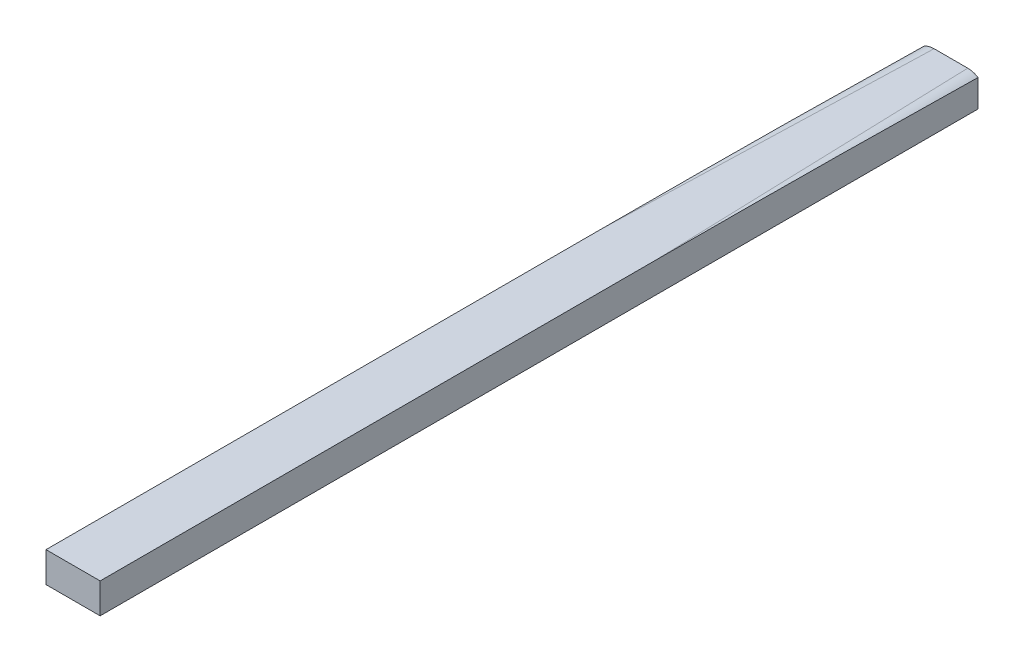
ISO-10303-21;
HEADER;
FILE_DESCRIPTION(('STEP AP214'),'2;1');
FILE_NAME('part.step','',(''),(''),'','','');
FILE_SCHEMA(('AUTOMOTIVE_DESIGN { 1 0 10303 214 1 1 1 1 }'));
ENDSEC;
DATA;
#1=APPLICATION_CONTEXT('core data for automotive mechanical design processes');
#2=APPLICATION_PROTOCOL_DEFINITION('international standard','automotive_design',2000,#1);
#3=PRODUCT_CONTEXT('',#1,'mechanical');
#4=PRODUCT('Part','Part','',(#3));
#5=PRODUCT_RELATED_PRODUCT_CATEGORY('part','',(#4));
#6=PRODUCT_DEFINITION_FORMATION('','',#4);
#7=PRODUCT_DEFINITION_CONTEXT('part definition',#1,'design');
#8=PRODUCT_DEFINITION('design','',#6,#7);
#9=PRODUCT_DEFINITION_SHAPE('','',#8);
#10=(LENGTH_UNIT() NAMED_UNIT(*) SI_UNIT(.MILLI.,.METRE.));
#11=(NAMED_UNIT(*) PLANE_ANGLE_UNIT() SI_UNIT($,.RADIAN.));
#12=(NAMED_UNIT(*) SI_UNIT($,.STERADIAN.) SOLID_ANGLE_UNIT());
#13=UNCERTAINTY_MEASURE_WITH_UNIT(LENGTH_MEASURE(1.E-05),#10,'distance_accuracy_value','');
#14=(GEOMETRIC_REPRESENTATION_CONTEXT(3) GLOBAL_UNCERTAINTY_ASSIGNED_CONTEXT((#13)) GLOBAL_UNIT_ASSIGNED_CONTEXT((#10,
#11,#12)) REPRESENTATION_CONTEXT('',''));
#15=CARTESIAN_POINT('',(0.,0.,0.));
#16=DIRECTION('',(0.,0.,1.));
#17=DIRECTION('',(1.,0.,0.));
#18=AXIS2_PLACEMENT_3D('',#15,#16,#17);
#19=CARTESIAN_POINT('',(0.,0.,-584.2));
#20=DIRECTION('',(0.,0.,1.));
#21=DIRECTION('',(1.,0.,0.));
#22=AXIS2_PLACEMENT_3D('',#19,#20,#21);
#23=PLANE('',#22);
#24=DIRECTION('',(0.,-1.,0.));
#25=VECTOR('',#24,1.);
#26=CARTESIAN_POINT('',(-18.161,0.,-584.2));
#27=LINE('',#26,#25);
#28=CARTESIAN_POINT('',(-18.161,49.911,-584.2));
#29=VERTEX_POINT('',#28);
#30=CARTESIAN_POINT('',(-18.161,29.591,-584.2));
#31=VERTEX_POINT('',#30);
#32=EDGE_CURVE('E118',#29,#31,#27,.T.);
#33=ORIENTED_EDGE('',*,*,#32,.T.);
#34=DIRECTION('',(1.,0.,0.));
#35=VECTOR('',#34,1.);
#36=CARTESIAN_POINT('',(0.,29.591,-584.2));
#37=LINE('',#36,#35);
#38=CARTESIAN_POINT('',(18.161,29.591,-584.2));
#39=VERTEX_POINT('',#38);
#40=EDGE_CURVE('E111',#31,#39,#37,.T.);
#41=ORIENTED_EDGE('',*,*,#40,.T.);
#42=DIRECTION('',(0.,-1.,0.));
#43=VECTOR('',#42,1.);
#44=CARTESIAN_POINT('',(18.161,0.,-584.2));
#45=LINE('',#44,#43);
#46=CARTESIAN_POINT('',(18.161,49.911,-584.2));
#47=VERTEX_POINT('',#46);
#48=EDGE_CURVE('E96',#47,#39,#45,.T.);
#49=ORIENTED_EDGE('',*,*,#48,.F.);
#50=DIRECTION('',(-1.,0.,0.));
#51=VECTOR('',#50,1.);
#52=CARTESIAN_POINT('',(-49.911,49.911,-584.2));
#53=LINE('',#52,#51);
#54=EDGE_CURVE('E109',#47,#29,#53,.T.);
#55=ORIENTED_EDGE('',*,*,#54,.T.);
#56=EDGE_LOOP('',(#33,#41,#49,#55));
#57=FACE_BOUND('',#56,.T.);
#58=ADVANCED_FACE('F43',(#57),#23,.T.);
#59=CARTESIAN_POINT('',(0.,29.591,0.));
#60=DIRECTION('',(0.,1.,0.));
#61=DIRECTION('',(0.,0.,1.));
#62=AXIS2_PLACEMENT_3D('',#59,#60,#61);
#63=PLANE('',#62);
#64=ORIENTED_EDGE('',*,*,#40,.F.);
#65=DIRECTION('',(0.,0.,1.));
#66=VECTOR('',#65,1.);
#67=CARTESIAN_POINT('',(-18.161,29.591,0.));
#68=LINE('',#67,#66);
#69=CARTESIAN_POINT('',(-18.161,29.591,-1173.17130026192));
#70=VERTEX_POINT('',#69);
#71=EDGE_CURVE('E51',#70,#31,#68,.T.);
#72=ORIENTED_EDGE('',*,*,#71,.F.);
#73=DIRECTION('',(-1.,0.,0.));
#74=VECTOR('',#73,1.);
#75=CARTESIAN_POINT('',(0.,29.591,-1173.17130026192));
#76=LINE('',#75,#74);
#77=CARTESIAN_POINT('',(18.161,29.591,-1173.17130026192));
#78=VERTEX_POINT('',#77);
#79=EDGE_CURVE('E58',#78,#70,#76,.T.);
#80=ORIENTED_EDGE('',*,*,#79,.F.);
#81=DIRECTION('',(0.,0.,1.));
#82=VECTOR('',#81,1.);
#83=CARTESIAN_POINT('',(18.161,29.591,0.));
#84=LINE('',#83,#82);
#85=EDGE_CURVE('E11',#78,#39,#84,.T.);
#86=ORIENTED_EDGE('',*,*,#85,.T.);
#87=EDGE_LOOP('',(#64,#72,#80,#86));
#88=FACE_BOUND('',#87,.T.);
#89=ADVANCED_FACE('F156',(#88),#63,.F.);
#90=CARTESIAN_POINT('',(-18.161,0.,0.));
#91=DIRECTION('',(1.,0.,0.));
#92=DIRECTION('',(0.,0.,-1.));
#93=AXIS2_PLACEMENT_3D('',#90,#91,#92);
#94=PLANE('',#93);
#95=ORIENTED_EDGE('',*,*,#32,.F.);
#96=DIRECTION('',(0.,0.,1.));
#97=VECTOR('',#96,1.);
#98=CARTESIAN_POINT('',(-18.161,49.911,25.4));
#99=LINE('',#98,#97);
#100=CARTESIAN_POINT('',(-18.161,49.911,-956.672711129882));
#101=VERTEX_POINT('',#100);
#102=EDGE_CURVE('E116',#101,#29,#99,.T.);
#103=ORIENTED_EDGE('',*,*,#102,.F.);
#104=CARTESIAN_POINT('',(-18.161,37.211,-956.672711129882));
#105=DIRECTION('',(1.,0.,0.));
#106=DIRECTION('',(0.,0.,1.));
#107=AXIS2_PLACEMENT_3D('',#104,#105,#106);
#108=ELLIPSE('',#107,400.982688870119,12.7);
#109=CARTESIAN_POINT('',(-18.161,47.9007971720491,-1173.17130026192));
#110=VERTEX_POINT('',#109);
#111=EDGE_CURVE('E103',#101,#110,#108,.F.);
#112=ORIENTED_EDGE('',*,*,#111,.T.);
#113=DIRECTION('',(0.,1.,0.));
#114=VECTOR('',#113,1.);
#115=CARTESIAN_POINT('',(-18.161,0.,-1173.17130026192));
#116=LINE('',#115,#114);
#117=EDGE_CURVE('E123',#70,#110,#116,.T.);
#118=ORIENTED_EDGE('',*,*,#117,.F.);
#119=ORIENTED_EDGE('',*,*,#71,.T.);
#120=EDGE_LOOP('',(#95,#103,#112,#118,#119));
#121=FACE_BOUND('',#120,.T.);
#122=ADVANCED_FACE('F154',(#121),#94,.F.);
#123=CARTESIAN_POINT('',(18.161,0.,0.));
#124=DIRECTION('',(1.,0.,0.));
#125=DIRECTION('',(0.,0.,-1.));
#126=AXIS2_PLACEMENT_3D('',#123,#124,#125);
#127=PLANE('',#126);
#128=DIRECTION('',(0.,0.,1.));
#129=VECTOR('',#128,1.);
#130=CARTESIAN_POINT('',(18.161,49.911,25.4));
#131=LINE('',#130,#129);
#132=CARTESIAN_POINT('',(18.161,49.911,-956.672711129881));
#133=VERTEX_POINT('',#132);
#134=EDGE_CURVE('E93',#133,#47,#131,.T.);
#135=ORIENTED_EDGE('',*,*,#134,.T.);
#136=ORIENTED_EDGE('',*,*,#48,.T.);
#137=ORIENTED_EDGE('',*,*,#85,.F.);
#138=DIRECTION('',(0.,1.,0.));
#139=VECTOR('',#138,1.);
#140=CARTESIAN_POINT('',(18.161,0.,-1173.17130026192));
#141=LINE('',#140,#139);
#142=CARTESIAN_POINT('',(18.161,47.900797172049,-1173.17130026192));
#143=VERTEX_POINT('',#142);
#144=EDGE_CURVE('E104',#78,#143,#141,.T.);
#145=ORIENTED_EDGE('',*,*,#144,.T.);
#146=CARTESIAN_POINT('',(18.161,37.211,-956.672711129881));
#147=DIRECTION('',(1.,0.,0.));
#148=DIRECTION('',(0.,0.,1.));
#149=AXIS2_PLACEMENT_3D('',#146,#147,#148);
#150=ELLIPSE('',#149,400.982688870118,12.7);
#151=EDGE_CURVE('E99',#133,#143,#150,.F.);
#152=ORIENTED_EDGE('',*,*,#151,.F.);
#153=EDGE_LOOP('',(#135,#136,#137,#145,#152));
#154=FACE_BOUND('',#153,.T.);
#155=ADVANCED_FACE('F95',(#154),#127,.T.);
#156=CARTESIAN_POINT('',(-49.911,49.911,25.4));
#157=DIRECTION('',(0.,-1.,0.));
#158=DIRECTION('',(0.,0.,-1.));
#159=AXIS2_PLACEMENT_3D('',#156,#157,#158);
#160=PLANE('',#159);
#161=ORIENTED_EDGE('',*,*,#54,.F.);
#162=ORIENTED_EDGE('',*,*,#134,.F.);
#163=DIRECTION('',(0.0316721902279269,0.,0.999498310336824));
#164=VECTOR('',#163,1.);
#165=CARTESIAN_POINT('',(49.1815040674601,49.911,22.2599480293983));
#166=LINE('',#165,#164);
#167=CARTESIAN_POINT('',(11.3005736959707,49.911,-1173.17130026192));
#168=VERTEX_POINT('',#167);
#169=EDGE_CURVE('E112',#133,#168,#166,.F.);
#170=ORIENTED_EDGE('',*,*,#169,.T.);
#171=DIRECTION('',(-1.,0.,0.));
#172=VECTOR('',#171,1.);
#173=CARTESIAN_POINT('',(-49.911,49.911,-1173.17130026192));
#174=LINE('',#173,#172);
#175=CARTESIAN_POINT('',(-11.3005736959707,49.911,-1173.17130026192));
#176=VERTEX_POINT('',#175);
#177=EDGE_CURVE('E147',#168,#176,#174,.T.);
#178=ORIENTED_EDGE('',*,*,#177,.T.);
#179=DIRECTION('',(-0.0316721902279268,0.,0.999498310336824));
#180=VECTOR('',#179,1.);
#181=CARTESIAN_POINT('',(-49.2816382741247,49.911,25.4199432696363));
#182=LINE('',#181,#180);
#183=EDGE_CURVE('E139',#176,#101,#182,.T.);
#184=ORIENTED_EDGE('',*,*,#183,.T.);
#185=ORIENTED_EDGE('',*,*,#102,.T.);
#186=EDGE_LOOP('',(#161,#162,#170,#178,#184,#185));
#187=FACE_BOUND('',#186,.T.);
#188=ADVANCED_FACE('F45',(#187),#160,.F.);
#189=CARTESIAN_POINT('',(0.,0.,-1173.17130026192));
#190=DIRECTION('',(0.,0.,1.));
#191=DIRECTION('',(1.,0.,0.));
#192=AXIS2_PLACEMENT_3D('',#189,#190,#191);
#193=PLANE('',#192);
#194=ORIENTED_EDGE('',*,*,#144,.F.);
#195=ORIENTED_EDGE('',*,*,#79,.T.);
#196=ORIENTED_EDGE('',*,*,#117,.T.);
#197=CARTESIAN_POINT('',(-11.3005736959707,37.211,-1173.17130026192));
#198=DIRECTION('',(0.,0.,1.));
#199=DIRECTION('',(-1.,0.,0.));
#200=AXIS2_PLACEMENT_3D('',#197,#198,#199);
#201=ELLIPSE('',#200,12.7063746568218,12.7);
#202=EDGE_CURVE('E140',#110,#176,#201,.F.);
#203=ORIENTED_EDGE('',*,*,#202,.T.);
#204=ORIENTED_EDGE('',*,*,#177,.F.);
#205=CARTESIAN_POINT('',(11.3005736959708,37.211,-1173.17130026192));
#206=DIRECTION('',(0.,0.,1.));
#207=DIRECTION('',(1.,0.,0.));
#208=AXIS2_PLACEMENT_3D('',#205,#206,#207);
#209=ELLIPSE('',#208,12.7063746568218,12.7);
#210=EDGE_CURVE('E142',#168,#143,#209,.F.);
#211=ORIENTED_EDGE('',*,*,#210,.T.);
#212=EDGE_LOOP('',(#194,#195,#196,#203,#204,#211));
#213=FACE_BOUND('',#212,.T.);
#214=ADVANCED_FACE('F170',(#213),#193,.F.);
#215=CARTESIAN_POINT('',(48.4275011351085,37.211,-1.5345749085833));
#216=DIRECTION('',(0.0316721902279269,0.,0.999498310336824));
#217=DIRECTION('',(0.999498310336824,0.,-0.0316721902279269));
#218=AXIS2_PLACEMENT_3D('',#215,#216,#217);
#219=CYLINDRICAL_SURFACE('',#218,12.7);
#220=ORIENTED_EDGE('',*,*,#169,.F.);
#221=ORIENTED_EDGE('',*,*,#151,.T.);
#222=ORIENTED_EDGE('',*,*,#210,.F.);
#223=EDGE_LOOP('',(#220,#221,#222));
#224=FACE_BOUND('',#223,.T.);
#225=ADVANCED_FACE('F167',(#224),#219,.T.);
#226=CARTESIAN_POINT('',(-49.2816382741247,37.211,25.4199432696363));
#227=DIRECTION('',(-0.0316721902279268,0.,0.999498310336824));
#228=DIRECTION('',(0.999498310336824,0.,0.0316721902279268));
#229=AXIS2_PLACEMENT_3D('',#226,#227,#228);
#230=CYLINDRICAL_SURFACE('',#229,12.7);
#231=ORIENTED_EDGE('',*,*,#111,.F.);
#232=ORIENTED_EDGE('',*,*,#183,.F.);
#233=ORIENTED_EDGE('',*,*,#202,.F.);
#234=EDGE_LOOP('',(#231,#232,#233));
#235=FACE_BOUND('',#234,.T.);
#236=ADVANCED_FACE('F153',(#235),#230,.T.);
#237=CLOSED_SHELL('',(#58,#89,#122,#155,#188,#214,#225,#236));
#238=MANIFOLD_SOLID_BREP('B2',#237);
#239=ADVANCED_BREP_SHAPE_REPRESENTATION('',(#18,#238),#14);
#240=SHAPE_DEFINITION_REPRESENTATION(#9,#239);
ENDSEC;
END-ISO-10303-21;
